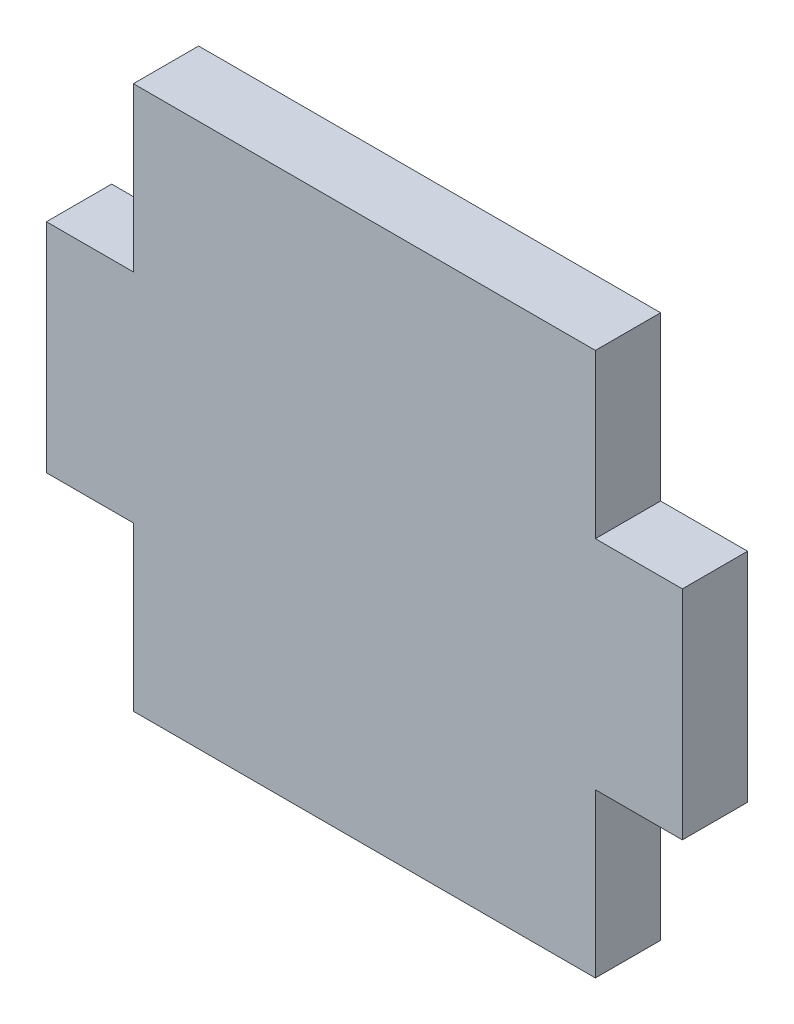
ISO-10303-21;
HEADER;
FILE_DESCRIPTION(('STEP AP214'),'2;1');
FILE_NAME('part.step','',(''),(''),'','','');
FILE_SCHEMA(('AUTOMOTIVE_DESIGN { 1 0 10303 214 1 1 1 1 }'));
ENDSEC;
DATA;
#1=APPLICATION_CONTEXT('core data for automotive mechanical design processes');
#2=APPLICATION_PROTOCOL_DEFINITION('international standard','automotive_design',2000,#1);
#3=PRODUCT_CONTEXT('',#1,'mechanical');
#4=PRODUCT('Part','Part','',(#3));
#5=PRODUCT_RELATED_PRODUCT_CATEGORY('part','',(#4));
#6=PRODUCT_DEFINITION_FORMATION('','',#4);
#7=PRODUCT_DEFINITION_CONTEXT('part definition',#1,'design');
#8=PRODUCT_DEFINITION('design','',#6,#7);
#9=PRODUCT_DEFINITION_SHAPE('','',#8);
#10=(LENGTH_UNIT() NAMED_UNIT(*) SI_UNIT(.MILLI.,.METRE.));
#11=(NAMED_UNIT(*) PLANE_ANGLE_UNIT() SI_UNIT($,.RADIAN.));
#12=(NAMED_UNIT(*) SI_UNIT($,.STERADIAN.) SOLID_ANGLE_UNIT());
#13=UNCERTAINTY_MEASURE_WITH_UNIT(LENGTH_MEASURE(1.E-05),#10,'distance_accuracy_value','');
#14=(GEOMETRIC_REPRESENTATION_CONTEXT(3) GLOBAL_UNCERTAINTY_ASSIGNED_CONTEXT((#13)) GLOBAL_UNIT_ASSIGNED_CONTEXT((#10,
#11,#12)) REPRESENTATION_CONTEXT('',''));
#15=CARTESIAN_POINT('',(0.,0.,0.));
#16=DIRECTION('',(0.,0.,1.));
#17=DIRECTION('',(1.,0.,0.));
#18=AXIS2_PLACEMENT_3D('',#15,#16,#17);
#19=CARTESIAN_POINT('',(10.625,-5.,3.));
#20=DIRECTION('',(-1.,0.,0.));
#21=DIRECTION('',(0.,0.,1.));
#22=AXIS2_PLACEMENT_3D('',#19,#20,#21);
#23=PLANE('',#22);
#24=DIRECTION('',(0.,1.,0.));
#25=VECTOR('',#24,1.);
#26=CARTESIAN_POINT('',(10.625,-5.,0.));
#27=LINE('',#26,#25);
#28=CARTESIAN_POINT('',(10.625,-12.5,0.));
#29=VERTEX_POINT('',#28);
#30=CARTESIAN_POINT('',(10.625,-5.,0.));
#31=VERTEX_POINT('',#30);
#32=EDGE_CURVE('E168',#29,#31,#27,.T.);
#33=ORIENTED_EDGE('',*,*,#32,.T.);
#34=DIRECTION('',(0.,0.,-1.));
#35=VECTOR('',#34,1.);
#36=CARTESIAN_POINT('',(10.625,-5.,3.));
#37=LINE('',#36,#35);
#38=CARTESIAN_POINT('',(10.625,-5.,3.));
#39=VERTEX_POINT('',#38);
#40=EDGE_CURVE('E11',#39,#31,#37,.T.);
#41=ORIENTED_EDGE('',*,*,#40,.F.);
#42=DIRECTION('',(0.,1.,0.));
#43=VECTOR('',#42,1.);
#44=CARTESIAN_POINT('',(10.625,-5.,3.));
#45=LINE('',#44,#43);
#46=CARTESIAN_POINT('',(10.625,-12.5,3.));
#47=VERTEX_POINT('',#46);
#48=EDGE_CURVE('E202',#47,#39,#45,.T.);
#49=ORIENTED_EDGE('',*,*,#48,.F.);
#50=DIRECTION('',(0.,0.,-1.));
#51=VECTOR('',#50,1.);
#52=CARTESIAN_POINT('',(10.625,-12.5,3.));
#53=LINE('',#52,#51);
#54=EDGE_CURVE('E164',#47,#29,#53,.T.);
#55=ORIENTED_EDGE('',*,*,#54,.T.);
#56=EDGE_LOOP('',(#33,#41,#49,#55));
#57=FACE_BOUND('',#56,.T.);
#58=ADVANCED_FACE('F43',(#57),#23,.F.);
#59=CARTESIAN_POINT('',(10.625,-5.,3.));
#60=DIRECTION('',(0.,1.,0.));
#61=DIRECTION('',(-1.,0.,0.));
#62=AXIS2_PLACEMENT_3D('',#59,#60,#61);
#63=PLANE('',#62);
#64=DIRECTION('',(1.,0.,0.));
#65=VECTOR('',#64,1.);
#66=CARTESIAN_POINT('',(10.625,-5.,0.));
#67=LINE('',#66,#65);
#68=CARTESIAN_POINT('',(14.625,-5.,0.));
#69=VERTEX_POINT('',#68);
#70=EDGE_CURVE('E172',#31,#69,#67,.T.);
#71=ORIENTED_EDGE('',*,*,#70,.T.);
#72=DIRECTION('',(0.,0.,-1.));
#73=VECTOR('',#72,1.);
#74=CARTESIAN_POINT('',(14.625,-5.,3.));
#75=LINE('',#74,#73);
#76=CARTESIAN_POINT('',(14.625,-5.,3.));
#77=VERTEX_POINT('',#76);
#78=EDGE_CURVE('E52',#77,#69,#75,.T.);
#79=ORIENTED_EDGE('',*,*,#78,.F.);
#80=DIRECTION('',(1.,0.,0.));
#81=VECTOR('',#80,1.);
#82=CARTESIAN_POINT('',(10.625,-5.,3.));
#83=LINE('',#82,#81);
#84=EDGE_CURVE('E115',#39,#77,#83,.T.);
#85=ORIENTED_EDGE('',*,*,#84,.F.);
#86=ORIENTED_EDGE('',*,*,#40,.T.);
#87=EDGE_LOOP('',(#71,#79,#85,#86));
#88=FACE_BOUND('',#87,.T.);
#89=ADVANCED_FACE('F296',(#88),#63,.F.);
#90=CARTESIAN_POINT('',(14.625,5.,3.));
#91=DIRECTION('',(-1.,0.,0.));
#92=DIRECTION('',(0.,0.,1.));
#93=AXIS2_PLACEMENT_3D('',#90,#91,#92);
#94=PLANE('',#93);
#95=DIRECTION('',(0.,1.,0.));
#96=VECTOR('',#95,1.);
#97=CARTESIAN_POINT('',(14.625,5.,0.));
#98=LINE('',#97,#96);
#99=CARTESIAN_POINT('',(14.625,5.,0.));
#100=VERTEX_POINT('',#99);
#101=EDGE_CURVE('E175',#69,#100,#98,.T.);
#102=ORIENTED_EDGE('',*,*,#101,.T.);
#103=DIRECTION('',(0.,0.,-1.));
#104=VECTOR('',#103,1.);
#105=CARTESIAN_POINT('',(14.625,5.,3.));
#106=LINE('',#105,#104);
#107=CARTESIAN_POINT('',(14.625,5.,3.));
#108=VERTEX_POINT('',#107);
#109=EDGE_CURVE('E229',#108,#100,#106,.T.);
#110=ORIENTED_EDGE('',*,*,#109,.F.);
#111=DIRECTION('',(0.,1.,0.));
#112=VECTOR('',#111,1.);
#113=CARTESIAN_POINT('',(14.625,5.,3.));
#114=LINE('',#113,#112);
#115=EDGE_CURVE('E239',#77,#108,#114,.T.);
#116=ORIENTED_EDGE('',*,*,#115,.F.);
#117=ORIENTED_EDGE('',*,*,#78,.T.);
#118=EDGE_LOOP('',(#102,#110,#116,#117));
#119=FACE_BOUND('',#118,.T.);
#120=ADVANCED_FACE('F237',(#119),#94,.F.);
#121=CARTESIAN_POINT('',(10.625,5.,3.));
#122=DIRECTION('',(0.,-1.,0.));
#123=DIRECTION('',(1.,0.,0.));
#124=AXIS2_PLACEMENT_3D('',#121,#122,#123);
#125=PLANE('',#124);
#126=DIRECTION('',(-1.,0.,0.));
#127=VECTOR('',#126,1.);
#128=CARTESIAN_POINT('',(10.625,5.,0.));
#129=LINE('',#128,#127);
#130=CARTESIAN_POINT('',(10.625,5.,0.));
#131=VERTEX_POINT('',#130);
#132=EDGE_CURVE('E178',#100,#131,#129,.T.);
#133=ORIENTED_EDGE('',*,*,#132,.T.);
#134=DIRECTION('',(0.,0.,-1.));
#135=VECTOR('',#134,1.);
#136=CARTESIAN_POINT('',(10.625,5.,3.));
#137=LINE('',#136,#135);
#138=CARTESIAN_POINT('',(10.625,5.,3.));
#139=VERTEX_POINT('',#138);
#140=EDGE_CURVE('E225',#139,#131,#137,.T.);
#141=ORIENTED_EDGE('',*,*,#140,.F.);
#142=DIRECTION('',(-1.,0.,0.));
#143=VECTOR('',#142,1.);
#144=CARTESIAN_POINT('',(10.625,5.,3.));
#145=LINE('',#144,#143);
#146=EDGE_CURVE('E258',#108,#139,#145,.T.);
#147=ORIENTED_EDGE('',*,*,#146,.F.);
#148=ORIENTED_EDGE('',*,*,#109,.T.);
#149=EDGE_LOOP('',(#133,#141,#147,#148));
#150=FACE_BOUND('',#149,.T.);
#151=ADVANCED_FACE('F248',(#150),#125,.F.);
#152=CARTESIAN_POINT('',(10.625,12.5,3.));
#153=DIRECTION('',(-1.,0.,0.));
#154=DIRECTION('',(0.,0.,1.));
#155=AXIS2_PLACEMENT_3D('',#152,#153,#154);
#156=PLANE('',#155);
#157=DIRECTION('',(0.,1.,0.));
#158=VECTOR('',#157,1.);
#159=CARTESIAN_POINT('',(10.625,12.5,0.));
#160=LINE('',#159,#158);
#161=CARTESIAN_POINT('',(10.625,12.5,0.));
#162=VERTEX_POINT('',#161);
#163=EDGE_CURVE('E181',#131,#162,#160,.T.);
#164=ORIENTED_EDGE('',*,*,#163,.T.);
#165=DIRECTION('',(0.,0.,-1.));
#166=VECTOR('',#165,1.);
#167=CARTESIAN_POINT('',(10.625,12.5,3.));
#168=LINE('',#167,#166);
#169=CARTESIAN_POINT('',(10.625,12.5,3.));
#170=VERTEX_POINT('',#169);
#171=EDGE_CURVE('E221',#170,#162,#168,.T.);
#172=ORIENTED_EDGE('',*,*,#171,.F.);
#173=DIRECTION('',(0.,1.,0.));
#174=VECTOR('',#173,1.);
#175=CARTESIAN_POINT('',(10.625,12.5,3.));
#176=LINE('',#175,#174);
#177=EDGE_CURVE('E254',#139,#170,#176,.T.);
#178=ORIENTED_EDGE('',*,*,#177,.F.);
#179=ORIENTED_EDGE('',*,*,#140,.T.);
#180=EDGE_LOOP('',(#164,#172,#178,#179));
#181=FACE_BOUND('',#180,.T.);
#182=ADVANCED_FACE('F252',(#181),#156,.F.);
#183=CARTESIAN_POINT('',(-10.625,12.5,3.));
#184=DIRECTION('',(0.,-1.,0.));
#185=DIRECTION('',(0.,0.,-1.));
#186=AXIS2_PLACEMENT_3D('',#183,#184,#185);
#187=PLANE('',#186);
#188=DIRECTION('',(-1.,0.,0.));
#189=VECTOR('',#188,1.);
#190=CARTESIAN_POINT('',(-10.625,12.5,0.));
#191=LINE('',#190,#189);
#192=CARTESIAN_POINT('',(-10.625,12.5,0.));
#193=VERTEX_POINT('',#192);
#194=EDGE_CURVE('E184',#162,#193,#191,.T.);
#195=ORIENTED_EDGE('',*,*,#194,.T.);
#196=DIRECTION('',(0.,0.,-1.));
#197=VECTOR('',#196,1.);
#198=CARTESIAN_POINT('',(-10.625,12.5,3.));
#199=LINE('',#198,#197);
#200=CARTESIAN_POINT('',(-10.625,12.5,3.));
#201=VERTEX_POINT('',#200);
#202=EDGE_CURVE('E217',#201,#193,#199,.T.);
#203=ORIENTED_EDGE('',*,*,#202,.F.);
#204=DIRECTION('',(-1.,0.,0.));
#205=VECTOR('',#204,1.);
#206=CARTESIAN_POINT('',(-10.625,12.5,3.));
#207=LINE('',#206,#205);
#208=EDGE_CURVE('E257',#170,#201,#207,.T.);
#209=ORIENTED_EDGE('',*,*,#208,.F.);
#210=ORIENTED_EDGE('',*,*,#171,.T.);
#211=EDGE_LOOP('',(#195,#203,#209,#210));
#212=FACE_BOUND('',#211,.T.);
#213=ADVANCED_FACE('F309',(#212),#187,.F.);
#214=CARTESIAN_POINT('',(-10.625,12.5,3.));
#215=DIRECTION('',(1.,0.,0.));
#216=DIRECTION('',(0.,1.,0.));
#217=AXIS2_PLACEMENT_3D('',#214,#215,#216);
#218=PLANE('',#217);
#219=DIRECTION('',(0.,-1.,0.));
#220=VECTOR('',#219,1.);
#221=CARTESIAN_POINT('',(-10.625,12.5,0.));
#222=LINE('',#221,#220);
#223=CARTESIAN_POINT('',(-10.625,5.,0.));
#224=VERTEX_POINT('',#223);
#225=EDGE_CURVE('E187',#193,#224,#222,.T.);
#226=ORIENTED_EDGE('',*,*,#225,.T.);
#227=DIRECTION('',(0.,0.,-1.));
#228=VECTOR('',#227,1.);
#229=CARTESIAN_POINT('',(-10.625,5.,3.));
#230=LINE('',#229,#228);
#231=CARTESIAN_POINT('',(-10.625,5.,3.));
#232=VERTEX_POINT('',#231);
#233=EDGE_CURVE('E213',#232,#224,#230,.T.);
#234=ORIENTED_EDGE('',*,*,#233,.F.);
#235=DIRECTION('',(0.,-1.,0.));
#236=VECTOR('',#235,1.);
#237=CARTESIAN_POINT('',(-10.625,12.5,3.));
#238=LINE('',#237,#236);
#239=EDGE_CURVE('E262',#201,#232,#238,.T.);
#240=ORIENTED_EDGE('',*,*,#239,.F.);
#241=ORIENTED_EDGE('',*,*,#202,.T.);
#242=EDGE_LOOP('',(#226,#234,#240,#241));
#243=FACE_BOUND('',#242,.T.);
#244=ADVANCED_FACE('F312',(#243),#218,.F.);
#245=CARTESIAN_POINT('',(-10.625,5.,3.));
#246=DIRECTION('',(0.,-1.,0.));
#247=DIRECTION('',(0.,0.,-1.));
#248=AXIS2_PLACEMENT_3D('',#245,#246,#247);
#249=PLANE('',#248);
#250=DIRECTION('',(-1.,0.,0.));
#251=VECTOR('',#250,1.);
#252=CARTESIAN_POINT('',(-10.625,5.,0.));
#253=LINE('',#252,#251);
#254=CARTESIAN_POINT('',(-14.625,5.,0.));
#255=VERTEX_POINT('',#254);
#256=EDGE_CURVE('E190',#224,#255,#253,.T.);
#257=ORIENTED_EDGE('',*,*,#256,.T.);
#258=DIRECTION('',(0.,0.,-1.));
#259=VECTOR('',#258,1.);
#260=CARTESIAN_POINT('',(-14.625,5.,3.));
#261=LINE('',#260,#259);
#262=CARTESIAN_POINT('',(-14.625,5.,3.));
#263=VERTEX_POINT('',#262);
#264=EDGE_CURVE('E209',#263,#255,#261,.T.);
#265=ORIENTED_EDGE('',*,*,#264,.F.);
#266=DIRECTION('',(-1.,0.,0.));
#267=VECTOR('',#266,1.);
#268=CARTESIAN_POINT('',(-10.625,5.,3.));
#269=LINE('',#268,#267);
#270=EDGE_CURVE('E269',#232,#263,#269,.T.);
#271=ORIENTED_EDGE('',*,*,#270,.F.);
#272=ORIENTED_EDGE('',*,*,#233,.T.);
#273=EDGE_LOOP('',(#257,#265,#271,#272));
#274=FACE_BOUND('',#273,.T.);
#275=ADVANCED_FACE('F277',(#274),#249,.F.);
#276=CARTESIAN_POINT('',(-14.625,5.,3.));
#277=DIRECTION('',(1.,0.,0.));
#278=DIRECTION('',(0.,0.,-1.));
#279=AXIS2_PLACEMENT_3D('',#276,#277,#278);
#280=PLANE('',#279);
#281=DIRECTION('',(0.,-1.,0.));
#282=VECTOR('',#281,1.);
#283=CARTESIAN_POINT('',(-14.625,5.,0.));
#284=LINE('',#283,#282);
#285=CARTESIAN_POINT('',(-14.625,-5.,0.));
#286=VERTEX_POINT('',#285);
#287=EDGE_CURVE('E193',#255,#286,#284,.T.);
#288=ORIENTED_EDGE('',*,*,#287,.T.);
#289=DIRECTION('',(0.,0.,-1.));
#290=VECTOR('',#289,1.);
#291=CARTESIAN_POINT('',(-14.625,-5.,3.));
#292=LINE('',#291,#290);
#293=CARTESIAN_POINT('',(-14.625,-5.,3.));
#294=VERTEX_POINT('',#293);
#295=EDGE_CURVE('E157',#294,#286,#292,.T.);
#296=ORIENTED_EDGE('',*,*,#295,.F.);
#297=DIRECTION('',(0.,-1.,0.));
#298=VECTOR('',#297,1.);
#299=CARTESIAN_POINT('',(-14.625,5.,3.));
#300=LINE('',#299,#298);
#301=EDGE_CURVE('E146',#263,#294,#300,.T.);
#302=ORIENTED_EDGE('',*,*,#301,.F.);
#303=ORIENTED_EDGE('',*,*,#264,.T.);
#304=EDGE_LOOP('',(#288,#296,#302,#303));
#305=FACE_BOUND('',#304,.T.);
#306=ADVANCED_FACE('F281',(#305),#280,.F.);
#307=CARTESIAN_POINT('',(-10.625,-5.,3.));
#308=DIRECTION('',(0.,1.,0.));
#309=DIRECTION('',(-1.,0.,0.));
#310=AXIS2_PLACEMENT_3D('',#307,#308,#309);
#311=PLANE('',#310);
#312=DIRECTION('',(1.,0.,0.));
#313=VECTOR('',#312,1.);
#314=CARTESIAN_POINT('',(-10.625,-5.,0.));
#315=LINE('',#314,#313);
#316=CARTESIAN_POINT('',(-10.625,-5.,0.));
#317=VERTEX_POINT('',#316);
#318=EDGE_CURVE('E155',#286,#317,#315,.T.);
#319=ORIENTED_EDGE('',*,*,#318,.T.);
#320=DIRECTION('',(0.,0.,-1.));
#321=VECTOR('',#320,1.);
#322=CARTESIAN_POINT('',(-10.625,-5.,3.));
#323=LINE('',#322,#321);
#324=CARTESIAN_POINT('',(-10.625,-5.,3.));
#325=VERTEX_POINT('',#324);
#326=EDGE_CURVE('E152',#325,#317,#323,.T.);
#327=ORIENTED_EDGE('',*,*,#326,.F.);
#328=DIRECTION('',(1.,0.,0.));
#329=VECTOR('',#328,1.);
#330=CARTESIAN_POINT('',(-10.625,-5.,3.));
#331=LINE('',#330,#329);
#332=EDGE_CURVE('E140',#294,#325,#331,.T.);
#333=ORIENTED_EDGE('',*,*,#332,.F.);
#334=ORIENTED_EDGE('',*,*,#295,.T.);
#335=EDGE_LOOP('',(#319,#327,#333,#334));
#336=FACE_BOUND('',#335,.T.);
#337=ADVANCED_FACE('F153',(#336),#311,.F.);
#338=CARTESIAN_POINT('',(-10.625,-5.,3.));
#339=DIRECTION('',(1.,0.,0.));
#340=DIRECTION('',(0.,0.,-1.));
#341=AXIS2_PLACEMENT_3D('',#338,#339,#340);
#342=PLANE('',#341);
#343=DIRECTION('',(0.,-1.,0.));
#344=VECTOR('',#343,1.);
#345=CARTESIAN_POINT('',(-10.625,-5.,0.));
#346=LINE('',#345,#344);
#347=CARTESIAN_POINT('',(-10.625,-12.5,0.));
#348=VERTEX_POINT('',#347);
#349=EDGE_CURVE('E101',#317,#348,#346,.T.);
#350=ORIENTED_EDGE('',*,*,#349,.T.);
#351=DIRECTION('',(0.,0.,-1.));
#352=VECTOR('',#351,1.);
#353=CARTESIAN_POINT('',(-10.625,-12.5,3.));
#354=LINE('',#353,#352);
#355=CARTESIAN_POINT('',(-10.625,-12.5,3.));
#356=VERTEX_POINT('',#355);
#357=EDGE_CURVE('E158',#356,#348,#354,.T.);
#358=ORIENTED_EDGE('',*,*,#357,.F.);
#359=DIRECTION('',(0.,-1.,0.));
#360=VECTOR('',#359,1.);
#361=CARTESIAN_POINT('',(-10.625,-5.,3.));
#362=LINE('',#361,#360);
#363=EDGE_CURVE('E144',#325,#356,#362,.T.);
#364=ORIENTED_EDGE('',*,*,#363,.F.);
#365=ORIENTED_EDGE('',*,*,#326,.T.);
#366=EDGE_LOOP('',(#350,#358,#364,#365));
#367=FACE_BOUND('',#366,.T.);
#368=ADVANCED_FACE('F160',(#367),#342,.F.);
#369=CARTESIAN_POINT('',(-10.625,-12.5,3.));
#370=DIRECTION('',(0.,1.,0.));
#371=DIRECTION('',(0.,0.,1.));
#372=AXIS2_PLACEMENT_3D('',#369,#370,#371);
#373=PLANE('',#372);
#374=DIRECTION('',(1.,0.,0.));
#375=VECTOR('',#374,1.);
#376=CARTESIAN_POINT('',(-10.625,-12.5,0.));
#377=LINE('',#376,#375);
#378=EDGE_CURVE('E107',#348,#29,#377,.T.);
#379=ORIENTED_EDGE('',*,*,#378,.T.);
#380=ORIENTED_EDGE('',*,*,#54,.F.);
#381=DIRECTION('',(1.,0.,0.));
#382=VECTOR('',#381,1.);
#383=CARTESIAN_POINT('',(-10.625,-12.5,3.));
#384=LINE('',#383,#382);
#385=EDGE_CURVE('E60',#356,#47,#384,.T.);
#386=ORIENTED_EDGE('',*,*,#385,.F.);
#387=ORIENTED_EDGE('',*,*,#357,.T.);
#388=EDGE_LOOP('',(#379,#380,#386,#387));
#389=FACE_BOUND('',#388,.T.);
#390=ADVANCED_FACE('F285',(#389),#373,.F.);
#391=CARTESIAN_POINT('',(0.,0.,3.));
#392=DIRECTION('',(0.,0.,1.));
#393=DIRECTION('',(1.,0.,0.));
#394=AXIS2_PLACEMENT_3D('',#391,#392,#393);
#395=PLANE('',#394);
#396=ORIENTED_EDGE('',*,*,#48,.T.);
#397=ORIENTED_EDGE('',*,*,#84,.T.);
#398=ORIENTED_EDGE('',*,*,#115,.T.);
#399=ORIENTED_EDGE('',*,*,#146,.T.);
#400=ORIENTED_EDGE('',*,*,#177,.T.);
#401=ORIENTED_EDGE('',*,*,#208,.T.);
#402=ORIENTED_EDGE('',*,*,#239,.T.);
#403=ORIENTED_EDGE('',*,*,#270,.T.);
#404=ORIENTED_EDGE('',*,*,#301,.T.);
#405=ORIENTED_EDGE('',*,*,#332,.T.);
#406=ORIENTED_EDGE('',*,*,#363,.T.);
#407=ORIENTED_EDGE('',*,*,#385,.T.);
#408=EDGE_LOOP('',(#396,#397,#398,#399,#400,#401,#402,#403,#404,#405,#406,#407));
#409=FACE_BOUND('',#408,.T.);
#410=ADVANCED_FACE('F142',(#409),#395,.T.);
#411=CARTESIAN_POINT('',(0.,0.,0.));
#412=DIRECTION('',(0.,0.,1.));
#413=DIRECTION('',(1.,0.,0.));
#414=AXIS2_PLACEMENT_3D('',#411,#412,#413);
#415=PLANE('',#414);
#416=ORIENTED_EDGE('',*,*,#32,.F.);
#417=ORIENTED_EDGE('',*,*,#378,.F.);
#418=ORIENTED_EDGE('',*,*,#349,.F.);
#419=ORIENTED_EDGE('',*,*,#318,.F.);
#420=ORIENTED_EDGE('',*,*,#287,.F.);
#421=ORIENTED_EDGE('',*,*,#256,.F.);
#422=ORIENTED_EDGE('',*,*,#225,.F.);
#423=ORIENTED_EDGE('',*,*,#194,.F.);
#424=ORIENTED_EDGE('',*,*,#163,.F.);
#425=ORIENTED_EDGE('',*,*,#132,.F.);
#426=ORIENTED_EDGE('',*,*,#101,.F.);
#427=ORIENTED_EDGE('',*,*,#70,.F.);
#428=EDGE_LOOP('',(#416,#417,#418,#419,#420,#421,#422,#423,#424,#425,#426,#427));
#429=FACE_BOUND('',#428,.T.);
#430=ADVANCED_FACE('F243',(#429),#415,.F.);
#431=CLOSED_SHELL('',(#58,#89,#120,#151,#182,#213,#244,#275,#306,#337,#368,#390,#410,#430));
#432=MANIFOLD_SOLID_BREP('B2',#431);
#433=ADVANCED_BREP_SHAPE_REPRESENTATION('',(#18,#432),#14);
#434=SHAPE_DEFINITION_REPRESENTATION(#9,#433);
ENDSEC;
END-ISO-10303-21;
